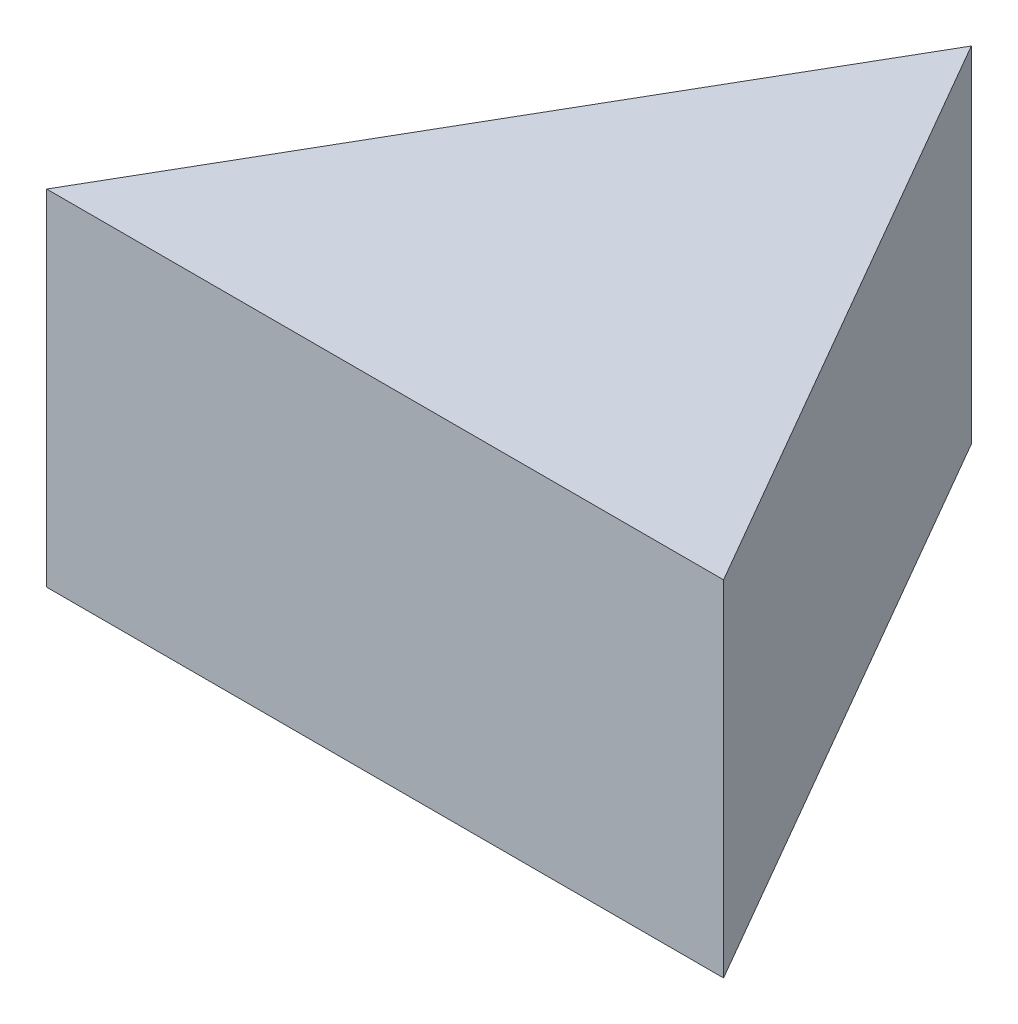
ISO-10303-21;
HEADER;
FILE_DESCRIPTION(('STEP AP214'),'2;1');
FILE_NAME('part.step','',(''),(''),'','','');
FILE_SCHEMA(('AUTOMOTIVE_DESIGN { 1 0 10303 214 1 1 1 1 }'));
ENDSEC;
DATA;
#1=APPLICATION_CONTEXT('core data for automotive mechanical design processes');
#2=APPLICATION_PROTOCOL_DEFINITION('international standard','automotive_design',2000,#1);
#3=PRODUCT_CONTEXT('',#1,'mechanical');
#4=PRODUCT('Part','Part','',(#3));
#5=PRODUCT_RELATED_PRODUCT_CATEGORY('part','',(#4));
#6=PRODUCT_DEFINITION_FORMATION('','',#4);
#7=PRODUCT_DEFINITION_CONTEXT('part definition',#1,'design');
#8=PRODUCT_DEFINITION('design','',#6,#7);
#9=PRODUCT_DEFINITION_SHAPE('','',#8);
#10=(LENGTH_UNIT() NAMED_UNIT(*) SI_UNIT(.MILLI.,.METRE.));
#11=(NAMED_UNIT(*) PLANE_ANGLE_UNIT() SI_UNIT($,.RADIAN.));
#12=(NAMED_UNIT(*) SI_UNIT($,.STERADIAN.) SOLID_ANGLE_UNIT());
#13=UNCERTAINTY_MEASURE_WITH_UNIT(LENGTH_MEASURE(1.E-05),#10,'distance_accuracy_value','');
#14=(GEOMETRIC_REPRESENTATION_CONTEXT(3) GLOBAL_UNCERTAINTY_ASSIGNED_CONTEXT((#13)) GLOBAL_UNIT_ASSIGNED_CONTEXT((#10,
#11,#12)) REPRESENTATION_CONTEXT('',''));
#15=CARTESIAN_POINT('',(0.,0.,0.));
#16=DIRECTION('',(0.,0.,1.));
#17=DIRECTION('',(1.,0.,0.));
#18=AXIS2_PLACEMENT_3D('',#15,#16,#17);
#19=CARTESIAN_POINT('',(-7.40747728811168,10.,-12.0475183232701));
#20=DIRECTION('',(0.866025403784436,0.,0.500000000000004));
#21=DIRECTION('',(0.500000000000004,0.,-0.866025403784436));
#22=AXIS2_PLACEMENT_3D('',#19,#20,#21);
#23=PLANE('',#22);
#24=DIRECTION('',(-0.500000000000004,0.,0.866025403784436));
#25=VECTOR('',#24,1.);
#26=CARTESIAN_POINT('',(-7.40747728811168,0.,-12.0475183232701));
#27=LINE('',#26,#25);
#28=CARTESIAN_POINT('',(-7.40747728811168,0.,-12.0475183232701));
#29=VERTEX_POINT('',#28);
#30=CARTESIAN_POINT('',(-17.2224318643354,0.,4.9524816767298));
#31=VERTEX_POINT('',#30);
#32=EDGE_CURVE('E79',#29,#31,#27,.T.);
#33=ORIENTED_EDGE('',*,*,#32,.T.);
#34=DIRECTION('',(0.,-1.,0.));
#35=VECTOR('',#34,1.);
#36=CARTESIAN_POINT('',(-17.2224318643354,10.,4.9524816767298));
#37=LINE('',#36,#35);
#38=CARTESIAN_POINT('',(-17.2224318643354,10.,4.9524816767298));
#39=VERTEX_POINT('',#38);
#40=EDGE_CURVE('E11',#39,#31,#37,.T.);
#41=ORIENTED_EDGE('',*,*,#40,.F.);
#42=DIRECTION('',(-0.500000000000004,0.,0.866025403784436));
#43=VECTOR('',#42,1.);
#44=CARTESIAN_POINT('',(-7.40747728811168,10.,-12.0475183232701));
#45=LINE('',#44,#43);
#46=CARTESIAN_POINT('',(-7.40747728811168,10.,-12.0475183232701));
#47=VERTEX_POINT('',#46);
#48=EDGE_CURVE('E74',#47,#39,#45,.T.);
#49=ORIENTED_EDGE('',*,*,#48,.F.);
#50=DIRECTION('',(0.,-1.,0.));
#51=VECTOR('',#50,1.);
#52=CARTESIAN_POINT('',(-7.40747728811168,10.,-12.0475183232701));
#53=LINE('',#52,#51);
#54=EDGE_CURVE('E49',#47,#29,#53,.T.);
#55=ORIENTED_EDGE('',*,*,#54,.T.);
#56=EDGE_LOOP('',(#33,#41,#49,#55));
#57=FACE_BOUND('',#56,.T.);
#58=ADVANCED_FACE('F33',(#57),#23,.F.);
#59=CARTESIAN_POINT('',(-17.2224318643354,10.,4.9524816767298));
#60=DIRECTION('',(0.,0.,-1.));
#61=DIRECTION('',(-1.,0.,0.));
#62=AXIS2_PLACEMENT_3D('',#59,#60,#61);
#63=PLANE('',#62);
#64=DIRECTION('',(1.,0.,0.));
#65=VECTOR('',#64,1.);
#66=CARTESIAN_POINT('',(-17.2224318643354,0.,4.9524816767298));
#67=LINE('',#66,#65);
#68=CARTESIAN_POINT('',(2.40747728811187,0.,4.9524816767298));
#69=VERTEX_POINT('',#68);
#70=EDGE_CURVE('E82',#31,#69,#67,.T.);
#71=ORIENTED_EDGE('',*,*,#70,.T.);
#72=DIRECTION('',(0.,-1.,0.));
#73=VECTOR('',#72,1.);
#74=CARTESIAN_POINT('',(2.40747728811187,10.,4.9524816767298));
#75=LINE('',#74,#73);
#76=CARTESIAN_POINT('',(2.40747728811187,10.,4.9524816767298));
#77=VERTEX_POINT('',#76);
#78=EDGE_CURVE('E41',#77,#69,#75,.T.);
#79=ORIENTED_EDGE('',*,*,#78,.F.);
#80=DIRECTION('',(1.,0.,0.));
#81=VECTOR('',#80,1.);
#82=CARTESIAN_POINT('',(-17.2224318643354,10.,4.9524816767298));
#83=LINE('',#82,#81);
#84=EDGE_CURVE('E67',#39,#77,#83,.T.);
#85=ORIENTED_EDGE('',*,*,#84,.F.);
#86=ORIENTED_EDGE('',*,*,#40,.T.);
#87=EDGE_LOOP('',(#71,#79,#85,#86));
#88=FACE_BOUND('',#87,.T.);
#89=ADVANCED_FACE('F69',(#88),#63,.F.);
#90=CARTESIAN_POINT('',(-7.40747728811168,10.,-12.0475183232701));
#91=DIRECTION('',(0.86602540378444,0.,-0.499999999999998));
#92=DIRECTION('',(-0.499999999999998,0.,-0.86602540378444));
#93=AXIS2_PLACEMENT_3D('',#90,#91,#92);
#94=PLANE('',#93);
#95=DIRECTION('',(0.499999999999998,0.,0.86602540378444));
#96=VECTOR('',#95,1.);
#97=CARTESIAN_POINT('',(-7.40747728811168,0.,-12.0475183232701));
#98=LINE('',#97,#96);
#99=EDGE_CURVE('E77',#29,#69,#98,.T.);
#100=ORIENTED_EDGE('',*,*,#99,.F.);
#101=ORIENTED_EDGE('',*,*,#54,.F.);
#102=DIRECTION('',(0.499999999999998,0.,0.86602540378444));
#103=VECTOR('',#102,1.);
#104=CARTESIAN_POINT('',(-7.40747728811168,10.,-12.0475183232701));
#105=LINE('',#104,#103);
#106=EDGE_CURVE('E73',#47,#77,#105,.T.);
#107=ORIENTED_EDGE('',*,*,#106,.T.);
#108=ORIENTED_EDGE('',*,*,#78,.T.);
#109=EDGE_LOOP('',(#100,#101,#107,#108));
#110=FACE_BOUND('',#109,.T.);
#111=ADVANCED_FACE('F88',(#110),#94,.T.);
#112=CARTESIAN_POINT('',(0.,10.,0.));
#113=DIRECTION('',(0.,1.,0.));
#114=DIRECTION('',(0.,0.,1.));
#115=AXIS2_PLACEMENT_3D('',#112,#113,#114);
#116=PLANE('',#115);
#117=ORIENTED_EDGE('',*,*,#48,.T.);
#118=ORIENTED_EDGE('',*,*,#84,.T.);
#119=ORIENTED_EDGE('',*,*,#106,.F.);
#120=EDGE_LOOP('',(#117,#118,#119));
#121=FACE_BOUND('',#120,.T.);
#122=ADVANCED_FACE('F76',(#121),#116,.T.);
#123=CARTESIAN_POINT('',(0.,0.,0.));
#124=DIRECTION('',(0.,1.,0.));
#125=DIRECTION('',(0.,0.,1.));
#126=AXIS2_PLACEMENT_3D('',#123,#124,#125);
#127=PLANE('',#126);
#128=ORIENTED_EDGE('',*,*,#32,.F.);
#129=ORIENTED_EDGE('',*,*,#99,.T.);
#130=ORIENTED_EDGE('',*,*,#70,.F.);
#131=EDGE_LOOP('',(#128,#129,#130));
#132=FACE_BOUND('',#131,.T.);
#133=ADVANCED_FACE('F95',(#132),#127,.F.);
#134=CLOSED_SHELL('',(#58,#89,#111,#122,#133));
#135=MANIFOLD_SOLID_BREP('B2',#134);
#136=ADVANCED_BREP_SHAPE_REPRESENTATION('',(#18,#135),#14);
#137=SHAPE_DEFINITION_REPRESENTATION(#9,#136);
ENDSEC;
END-ISO-10303-21;
